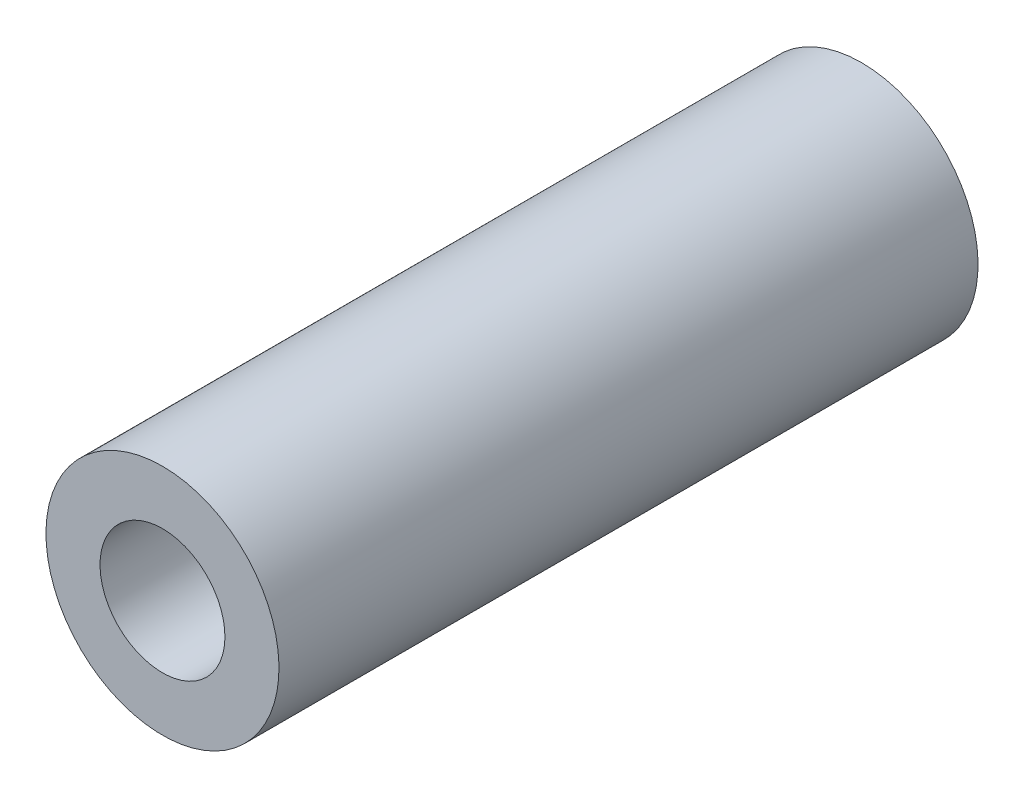
ISO-10303-21;
HEADER;
FILE_DESCRIPTION(('STEP AP214'),'2;1');
FILE_NAME('part.step','',(''),(''),'','','');
FILE_SCHEMA(('AUTOMOTIVE_DESIGN { 1 0 10303 214 1 1 1 1 }'));
ENDSEC;
DATA;
#1=APPLICATION_CONTEXT('core data for automotive mechanical design processes');
#2=APPLICATION_PROTOCOL_DEFINITION('international standard','automotive_design',2000,#1);
#3=PRODUCT_CONTEXT('',#1,'mechanical');
#4=PRODUCT('Part','Part','',(#3));
#5=PRODUCT_RELATED_PRODUCT_CATEGORY('part','',(#4));
#6=PRODUCT_DEFINITION_FORMATION('','',#4);
#7=PRODUCT_DEFINITION_CONTEXT('part definition',#1,'design');
#8=PRODUCT_DEFINITION('design','',#6,#7);
#9=PRODUCT_DEFINITION_SHAPE('','',#8);
#10=(LENGTH_UNIT() NAMED_UNIT(*) SI_UNIT(.MILLI.,.METRE.));
#11=(NAMED_UNIT(*) PLANE_ANGLE_UNIT() SI_UNIT($,.RADIAN.));
#12=(NAMED_UNIT(*) SI_UNIT($,.STERADIAN.) SOLID_ANGLE_UNIT());
#13=UNCERTAINTY_MEASURE_WITH_UNIT(LENGTH_MEASURE(1.E-05),#10,'distance_accuracy_value','');
#14=(GEOMETRIC_REPRESENTATION_CONTEXT(3) GLOBAL_UNCERTAINTY_ASSIGNED_CONTEXT((#13)) GLOBAL_UNIT_ASSIGNED_CONTEXT((#10,
#11,#12)) REPRESENTATION_CONTEXT('',''));
#15=CARTESIAN_POINT('',(0.,0.,0.));
#16=DIRECTION('',(0.,0.,1.));
#17=DIRECTION('',(1.,0.,0.));
#18=AXIS2_PLACEMENT_3D('',#15,#16,#17);
#19=CARTESIAN_POINT('',(0.,0.,14.2875));
#20=DIRECTION('',(0.,0.,-1.));
#21=DIRECTION('',(0.,1.,0.));
#22=AXIS2_PLACEMENT_3D('',#19,#20,#21);
#23=CYLINDRICAL_SURFACE('',#22,2.5527);
#24=CARTESIAN_POINT('',(0.,0.,-14.2875));
#25=DIRECTION('',(0.,0.,-1.));
#26=DIRECTION('',(0.,1.,0.));
#27=AXIS2_PLACEMENT_3D('',#24,#25,#26);
#28=CIRCLE('',#27,2.5527);
#29=CARTESIAN_POINT('',(0.,2.55270000000003,-14.2875));
#30=VERTEX_POINT('',#29);
#31=EDGE_CURVE('E27',#30,#30,#28,.T.);
#32=ORIENTED_EDGE('',*,*,#31,.T.);
#33=EDGE_LOOP('',(#32));
#34=FACE_BOUND('',#33,.T.);
#35=CARTESIAN_POINT('',(0.,0.,14.2875));
#36=DIRECTION('',(0.,0.,-1.));
#37=DIRECTION('',(0.,1.,0.));
#38=AXIS2_PLACEMENT_3D('',#35,#36,#37);
#39=CIRCLE('',#38,2.5527);
#40=CARTESIAN_POINT('',(0.,2.55270000000003,14.2875));
#41=VERTEX_POINT('',#40);
#42=EDGE_CURVE('E18',#41,#41,#39,.T.);
#43=ORIENTED_EDGE('',*,*,#42,.F.);
#44=EDGE_LOOP('',(#43));
#45=FACE_BOUND('',#44,.T.);
#46=ADVANCED_FACE('F15',(#34,#45),#23,.F.);
#47=CARTESIAN_POINT('',(0.,0.,14.2875));
#48=DIRECTION('',(0.,0.,1.));
#49=DIRECTION('',(0.,-1.,0.));
#50=AXIS2_PLACEMENT_3D('',#47,#48,#49);
#51=PLANE('',#50);
#52=ORIENTED_EDGE('',*,*,#42,.T.);
#53=EDGE_LOOP('',(#52));
#54=FACE_BOUND('',#53,.T.);
#55=CARTESIAN_POINT('',(0.,0.,14.2875));
#56=DIRECTION('',(0.,0.,-1.));
#57=DIRECTION('',(0.,1.,0.));
#58=AXIS2_PLACEMENT_3D('',#55,#56,#57);
#59=CIRCLE('',#58,4.7625);
#60=CARTESIAN_POINT('',(0.,4.76250000000003,14.2875));
#61=VERTEX_POINT('',#60);
#62=EDGE_CURVE('E22',#61,#61,#59,.T.);
#63=ORIENTED_EDGE('',*,*,#62,.F.);
#64=EDGE_LOOP('',(#63));
#65=FACE_BOUND('',#64,.T.);
#66=ADVANCED_FACE('F35',(#54,#65),#51,.T.);
#67=CARTESIAN_POINT('',(0.,0.,-14.2875));
#68=DIRECTION('',(0.,0.,1.));
#69=DIRECTION('',(0.,-1.,0.));
#70=AXIS2_PLACEMENT_3D('',#67,#68,#69);
#71=PLANE('',#70);
#72=ORIENTED_EDGE('',*,*,#31,.F.);
#73=EDGE_LOOP('',(#72));
#74=FACE_BOUND('',#73,.T.);
#75=CARTESIAN_POINT('',(0.,0.,-14.2875));
#76=DIRECTION('',(0.,0.,-1.));
#77=DIRECTION('',(0.,1.,0.));
#78=AXIS2_PLACEMENT_3D('',#75,#76,#77);
#79=CIRCLE('',#78,4.7625);
#80=CARTESIAN_POINT('',(0.,4.76250000000003,-14.2875));
#81=VERTEX_POINT('',#80);
#82=EDGE_CURVE('E9',#81,#81,#79,.F.);
#83=ORIENTED_EDGE('',*,*,#82,.F.);
#84=EDGE_LOOP('',(#83));
#85=FACE_BOUND('',#84,.T.);
#86=ADVANCED_FACE('F42',(#74,#85),#71,.F.);
#87=CARTESIAN_POINT('',(0.,0.,14.2875));
#88=DIRECTION('',(0.,0.,-1.));
#89=DIRECTION('',(0.,1.,0.));
#90=AXIS2_PLACEMENT_3D('',#87,#88,#89);
#91=CYLINDRICAL_SURFACE('',#90,4.7625);
#92=ORIENTED_EDGE('',*,*,#82,.T.);
#93=EDGE_LOOP('',(#92));
#94=FACE_BOUND('',#93,.T.);
#95=ORIENTED_EDGE('',*,*,#62,.T.);
#96=EDGE_LOOP('',(#95));
#97=FACE_BOUND('',#96,.T.);
#98=ADVANCED_FACE('F43',(#94,#97),#91,.T.);
#99=CLOSED_SHELL('',(#46,#66,#86,#98));
#100=MANIFOLD_SOLID_BREP('B1',#99);
#101=ADVANCED_BREP_SHAPE_REPRESENTATION('',(#18,#100),#14);
#102=SHAPE_DEFINITION_REPRESENTATION(#9,#101);
ENDSEC;
END-ISO-10303-21;
